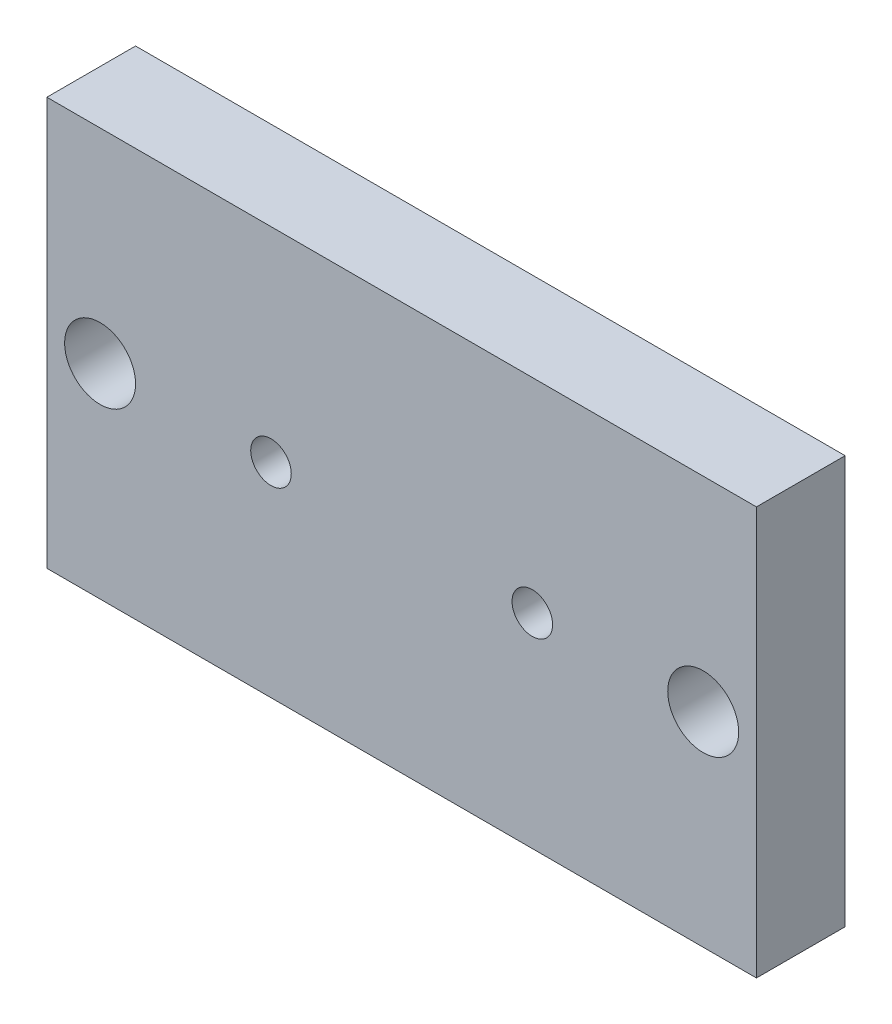
ISO-10303-21;
HEADER;
FILE_DESCRIPTION(('STEP AP214'),'2;1');
FILE_NAME('part.step','',(''),(''),'','','');
FILE_SCHEMA(('AUTOMOTIVE_DESIGN { 1 0 10303 214 1 1 1 1 }'));
ENDSEC;
DATA;
#1=APPLICATION_CONTEXT('core data for automotive mechanical design processes');
#2=APPLICATION_PROTOCOL_DEFINITION('international standard','automotive_design',2000,#1);
#3=PRODUCT_CONTEXT('',#1,'mechanical');
#4=PRODUCT('Part','Part','',(#3));
#5=PRODUCT_RELATED_PRODUCT_CATEGORY('part','',(#4));
#6=PRODUCT_DEFINITION_FORMATION('','',#4);
#7=PRODUCT_DEFINITION_CONTEXT('part definition',#1,'design');
#8=PRODUCT_DEFINITION('design','',#6,#7);
#9=PRODUCT_DEFINITION_SHAPE('','',#8);
#10=(LENGTH_UNIT() NAMED_UNIT(*) SI_UNIT(.MILLI.,.METRE.));
#11=(NAMED_UNIT(*) PLANE_ANGLE_UNIT() SI_UNIT($,.RADIAN.));
#12=(NAMED_UNIT(*) SI_UNIT($,.STERADIAN.) SOLID_ANGLE_UNIT());
#13=UNCERTAINTY_MEASURE_WITH_UNIT(LENGTH_MEASURE(1.E-05),#10,'distance_accuracy_value','');
#14=(GEOMETRIC_REPRESENTATION_CONTEXT(3) GLOBAL_UNCERTAINTY_ASSIGNED_CONTEXT((#13)) GLOBAL_UNIT_ASSIGNED_CONTEXT((#10,
#11,#12)) REPRESENTATION_CONTEXT('',''));
#15=CARTESIAN_POINT('',(0.,0.,0.));
#16=DIRECTION('',(0.,0.,1.));
#17=DIRECTION('',(1.,0.,0.));
#18=AXIS2_PLACEMENT_3D('',#15,#16,#17);
#19=CARTESIAN_POINT('',(-20.,11.5,5.));
#20=DIRECTION('',(1.,0.,0.));
#21=DIRECTION('',(0.,1.,0.));
#22=AXIS2_PLACEMENT_3D('',#19,#20,#21);
#23=PLANE('',#22);
#24=DIRECTION('',(0.,-1.,0.));
#25=VECTOR('',#24,1.);
#26=CARTESIAN_POINT('',(-20.,11.5,0.));
#27=LINE('',#26,#25);
#28=CARTESIAN_POINT('',(-20.,11.5,0.));
#29=VERTEX_POINT('',#28);
#30=CARTESIAN_POINT('',(-20.,-11.5,0.));
#31=VERTEX_POINT('',#30);
#32=EDGE_CURVE('E99',#29,#31,#27,.T.);
#33=ORIENTED_EDGE('',*,*,#32,.T.);
#34=DIRECTION('',(0.,0.,-1.));
#35=VECTOR('',#34,1.);
#36=CARTESIAN_POINT('',(-20.,-11.5,5.));
#37=LINE('',#36,#35);
#38=CARTESIAN_POINT('',(-20.,-11.5,5.));
#39=VERTEX_POINT('',#38);
#40=EDGE_CURVE('E11',#39,#31,#37,.T.);
#41=ORIENTED_EDGE('',*,*,#40,.F.);
#42=DIRECTION('',(0.,-1.,0.));
#43=VECTOR('',#42,1.);
#44=CARTESIAN_POINT('',(-20.,11.5,5.));
#45=LINE('',#44,#43);
#46=CARTESIAN_POINT('',(-20.,11.5,5.));
#47=VERTEX_POINT('',#46);
#48=EDGE_CURVE('E87',#47,#39,#45,.T.);
#49=ORIENTED_EDGE('',*,*,#48,.F.);
#50=DIRECTION('',(0.,0.,-1.));
#51=VECTOR('',#50,1.);
#52=CARTESIAN_POINT('',(-20.,11.5,5.));
#53=LINE('',#52,#51);
#54=EDGE_CURVE('E95',#47,#29,#53,.T.);
#55=ORIENTED_EDGE('',*,*,#54,.T.);
#56=EDGE_LOOP('',(#33,#41,#49,#55));
#57=FACE_BOUND('',#56,.T.);
#58=ADVANCED_FACE('F36',(#57),#23,.F.);
#59=CARTESIAN_POINT('',(-20.,-11.5,5.));
#60=DIRECTION('',(0.,1.,0.));
#61=DIRECTION('',(0.,0.,1.));
#62=AXIS2_PLACEMENT_3D('',#59,#60,#61);
#63=PLANE('',#62);
#64=DIRECTION('',(1.,0.,0.));
#65=VECTOR('',#64,1.);
#66=CARTESIAN_POINT('',(-20.,-11.5,0.));
#67=LINE('',#66,#65);
#68=CARTESIAN_POINT('',(20.,-11.5,0.));
#69=VERTEX_POINT('',#68);
#70=EDGE_CURVE('E91',#31,#69,#67,.T.);
#71=ORIENTED_EDGE('',*,*,#70,.T.);
#72=DIRECTION('',(0.,0.,-1.));
#73=VECTOR('',#72,1.);
#74=CARTESIAN_POINT('',(20.,-11.5,5.));
#75=LINE('',#74,#73);
#76=CARTESIAN_POINT('',(20.,-11.5,5.));
#77=VERTEX_POINT('',#76);
#78=EDGE_CURVE('E44',#77,#69,#75,.T.);
#79=ORIENTED_EDGE('',*,*,#78,.F.);
#80=DIRECTION('',(1.,0.,0.));
#81=VECTOR('',#80,1.);
#82=CARTESIAN_POINT('',(-20.,-11.5,5.));
#83=LINE('',#82,#81);
#84=EDGE_CURVE('E82',#39,#77,#83,.T.);
#85=ORIENTED_EDGE('',*,*,#84,.F.);
#86=ORIENTED_EDGE('',*,*,#40,.T.);
#87=EDGE_LOOP('',(#71,#79,#85,#86));
#88=FACE_BOUND('',#87,.T.);
#89=ADVANCED_FACE('F90',(#88),#63,.F.);
#90=CARTESIAN_POINT('',(20.,11.5,5.));
#91=DIRECTION('',(-1.,0.,0.));
#92=DIRECTION('',(0.,-1.,0.));
#93=AXIS2_PLACEMENT_3D('',#90,#91,#92);
#94=PLANE('',#93);
#95=DIRECTION('',(0.,1.,0.));
#96=VECTOR('',#95,1.);
#97=CARTESIAN_POINT('',(20.,11.5,0.));
#98=LINE('',#97,#96);
#99=CARTESIAN_POINT('',(20.,11.5,0.));
#100=VERTEX_POINT('',#99);
#101=EDGE_CURVE('E69',#69,#100,#98,.T.);
#102=ORIENTED_EDGE('',*,*,#101,.T.);
#103=DIRECTION('',(0.,0.,-1.));
#104=VECTOR('',#103,1.);
#105=CARTESIAN_POINT('',(20.,11.5,5.));
#106=LINE('',#105,#104);
#107=CARTESIAN_POINT('',(20.,11.5,5.));
#108=VERTEX_POINT('',#107);
#109=EDGE_CURVE('E92',#108,#100,#106,.T.);
#110=ORIENTED_EDGE('',*,*,#109,.F.);
#111=DIRECTION('',(0.,1.,0.));
#112=VECTOR('',#111,1.);
#113=CARTESIAN_POINT('',(20.,11.5,5.));
#114=LINE('',#113,#112);
#115=EDGE_CURVE('E85',#77,#108,#114,.T.);
#116=ORIENTED_EDGE('',*,*,#115,.F.);
#117=ORIENTED_EDGE('',*,*,#78,.T.);
#118=EDGE_LOOP('',(#102,#110,#116,#117));
#119=FACE_BOUND('',#118,.T.);
#120=ADVANCED_FACE('F93',(#119),#94,.F.);
#121=CARTESIAN_POINT('',(-20.,11.5,5.));
#122=DIRECTION('',(0.,-1.,0.));
#123=DIRECTION('',(0.,0.,-1.));
#124=AXIS2_PLACEMENT_3D('',#121,#122,#123);
#125=PLANE('',#124);
#126=DIRECTION('',(-1.,0.,0.));
#127=VECTOR('',#126,1.);
#128=CARTESIAN_POINT('',(-20.,11.5,0.));
#129=LINE('',#128,#127);
#130=EDGE_CURVE('E75',#100,#29,#129,.T.);
#131=ORIENTED_EDGE('',*,*,#130,.T.);
#132=ORIENTED_EDGE('',*,*,#54,.F.);
#133=DIRECTION('',(-1.,0.,0.));
#134=VECTOR('',#133,1.);
#135=CARTESIAN_POINT('',(-20.,11.5,5.));
#136=LINE('',#135,#134);
#137=EDGE_CURVE('E52',#108,#47,#136,.T.);
#138=ORIENTED_EDGE('',*,*,#137,.F.);
#139=ORIENTED_EDGE('',*,*,#109,.T.);
#140=EDGE_LOOP('',(#131,#132,#138,#139));
#141=FACE_BOUND('',#140,.T.);
#142=ADVANCED_FACE('F107',(#141),#125,.F.);
#143=CARTESIAN_POINT('',(0.,0.,5.));
#144=DIRECTION('',(0.,0.,1.));
#145=DIRECTION('',(1.,0.,0.));
#146=AXIS2_PLACEMENT_3D('',#143,#144,#145);
#147=PLANE('',#146);
#148=CARTESIAN_POINT('',(16.9999999999999,0.,5.));
#149=DIRECTION('',(0.,0.,1.));
#150=DIRECTION('',(1.,0.,0.));
#151=AXIS2_PLACEMENT_3D('',#148,#149,#150);
#152=CIRCLE('',#151,2.00000000000001);
#153=CARTESIAN_POINT('',(18.9999999999999,0.,5.));
#154=VERTEX_POINT('',#153);
#155=EDGE_CURVE('E102',#154,#154,#152,.T.);
#156=ORIENTED_EDGE('',*,*,#155,.F.);
#157=EDGE_LOOP('',(#156));
#158=FACE_BOUND('',#157,.T.);
#159=CARTESIAN_POINT('',(7.36599999999997,0.,5.));
#160=DIRECTION('',(0.,0.,1.));
#161=DIRECTION('',(1.,0.,0.));
#162=AXIS2_PLACEMENT_3D('',#159,#160,#161);
#163=CIRCLE('',#162,1.143);
#164=CARTESIAN_POINT('',(8.50899999999997,0.,5.));
#165=VERTEX_POINT('',#164);
#166=EDGE_CURVE('E115',#165,#165,#163,.T.);
#167=ORIENTED_EDGE('',*,*,#166,.F.);
#168=EDGE_LOOP('',(#167));
#169=FACE_BOUND('',#168,.T.);
#170=CARTESIAN_POINT('',(-7.36600000000003,0.,5.));
#171=DIRECTION('',(0.,0.,1.));
#172=DIRECTION('',(1.,0.,0.));
#173=AXIS2_PLACEMENT_3D('',#170,#171,#172);
#174=CIRCLE('',#173,1.143);
#175=CARTESIAN_POINT('',(-6.22300000000003,0.,5.));
#176=VERTEX_POINT('',#175);
#177=EDGE_CURVE('E118',#176,#176,#174,.T.);
#178=ORIENTED_EDGE('',*,*,#177,.F.);
#179=EDGE_LOOP('',(#178));
#180=FACE_BOUND('',#179,.T.);
#181=CARTESIAN_POINT('',(-17.0000000000001,0.,5.));
#182=DIRECTION('',(0.,0.,1.));
#183=DIRECTION('',(1.,0.,0.));
#184=AXIS2_PLACEMENT_3D('',#181,#182,#183);
#185=CIRCLE('',#184,2.);
#186=CARTESIAN_POINT('',(-15.0000000000001,0.,5.));
#187=VERTEX_POINT('',#186);
#188=EDGE_CURVE('E121',#187,#187,#185,.T.);
#189=ORIENTED_EDGE('',*,*,#188,.F.);
#190=EDGE_LOOP('',(#189));
#191=FACE_BOUND('',#190,.T.);
#192=ORIENTED_EDGE('',*,*,#48,.T.);
#193=ORIENTED_EDGE('',*,*,#84,.T.);
#194=ORIENTED_EDGE('',*,*,#115,.T.);
#195=ORIENTED_EDGE('',*,*,#137,.T.);
#196=EDGE_LOOP('',(#192,#193,#194,#195));
#197=FACE_BOUND('',#196,.T.);
#198=ADVANCED_FACE('F83',(#158,#169,#180,#191,#197),#147,.T.);
#199=CARTESIAN_POINT('',(0.,0.,0.));
#200=DIRECTION('',(0.,0.,1.));
#201=DIRECTION('',(1.,0.,0.));
#202=AXIS2_PLACEMENT_3D('',#199,#200,#201);
#203=PLANE('',#202);
#204=CARTESIAN_POINT('',(16.9999999999999,0.,0.));
#205=DIRECTION('',(0.,0.,-1.));
#206=DIRECTION('',(-1.,0.,0.));
#207=AXIS2_PLACEMENT_3D('',#204,#205,#206);
#208=CIRCLE('',#207,2.00000000000001);
#209=CARTESIAN_POINT('',(14.9999999999999,0.,0.));
#210=VERTEX_POINT('',#209);
#211=EDGE_CURVE('E124',#210,#210,#208,.T.);
#212=ORIENTED_EDGE('',*,*,#211,.F.);
#213=EDGE_LOOP('',(#212));
#214=FACE_BOUND('',#213,.T.);
#215=CARTESIAN_POINT('',(7.36599999999997,0.,0.));
#216=DIRECTION('',(0.,0.,-1.));
#217=DIRECTION('',(-1.,0.,0.));
#218=AXIS2_PLACEMENT_3D('',#215,#216,#217);
#219=CIRCLE('',#218,1.143);
#220=CARTESIAN_POINT('',(6.22299999999997,0.,0.));
#221=VERTEX_POINT('',#220);
#222=EDGE_CURVE('E131',#221,#221,#219,.T.);
#223=ORIENTED_EDGE('',*,*,#222,.F.);
#224=EDGE_LOOP('',(#223));
#225=FACE_BOUND('',#224,.T.);
#226=CARTESIAN_POINT('',(-7.36600000000003,0.,0.));
#227=DIRECTION('',(0.,0.,-1.));
#228=DIRECTION('',(-1.,0.,0.));
#229=AXIS2_PLACEMENT_3D('',#226,#227,#228);
#230=CIRCLE('',#229,1.143);
#231=CARTESIAN_POINT('',(-8.50900000000003,0.,0.));
#232=VERTEX_POINT('',#231);
#233=EDGE_CURVE('E128',#232,#232,#230,.T.);
#234=ORIENTED_EDGE('',*,*,#233,.F.);
#235=EDGE_LOOP('',(#234));
#236=FACE_BOUND('',#235,.T.);
#237=CARTESIAN_POINT('',(-17.0000000000001,0.,0.));
#238=DIRECTION('',(0.,0.,-1.));
#239=DIRECTION('',(-1.,0.,0.));
#240=AXIS2_PLACEMENT_3D('',#237,#238,#239);
#241=CIRCLE('',#240,2.);
#242=CARTESIAN_POINT('',(-19.0000000000001,0.,0.));
#243=VERTEX_POINT('',#242);
#244=EDGE_CURVE('E125',#243,#243,#241,.T.);
#245=ORIENTED_EDGE('',*,*,#244,.F.);
#246=EDGE_LOOP('',(#245));
#247=FACE_BOUND('',#246,.T.);
#248=ORIENTED_EDGE('',*,*,#32,.F.);
#249=ORIENTED_EDGE('',*,*,#130,.F.);
#250=ORIENTED_EDGE('',*,*,#101,.F.);
#251=ORIENTED_EDGE('',*,*,#70,.F.);
#252=EDGE_LOOP('',(#248,#249,#250,#251));
#253=FACE_BOUND('',#252,.T.);
#254=ADVANCED_FACE('F110',(#214,#225,#236,#247,#253),#203,.F.);
#255=CARTESIAN_POINT('',(-17.0000000000001,0.,10.));
#256=DIRECTION('',(0.,0.,-1.));
#257=DIRECTION('',(-1.,0.,0.));
#258=AXIS2_PLACEMENT_3D('',#255,#256,#257);
#259=CYLINDRICAL_SURFACE('',#258,2.);
#260=ORIENTED_EDGE('',*,*,#188,.T.);
#261=EDGE_LOOP('',(#260));
#262=FACE_BOUND('',#261,.T.);
#263=ORIENTED_EDGE('',*,*,#244,.T.);
#264=EDGE_LOOP('',(#263));
#265=FACE_BOUND('',#264,.T.);
#266=ADVANCED_FACE('F141',(#262,#265),#259,.F.);
#267=CARTESIAN_POINT('',(-7.36600000000003,0.,10.));
#268=DIRECTION('',(0.,0.,-1.));
#269=DIRECTION('',(-1.,0.,0.));
#270=AXIS2_PLACEMENT_3D('',#267,#268,#269);
#271=CYLINDRICAL_SURFACE('',#270,1.143);
#272=ORIENTED_EDGE('',*,*,#177,.T.);
#273=EDGE_LOOP('',(#272));
#274=FACE_BOUND('',#273,.T.);
#275=ORIENTED_EDGE('',*,*,#233,.T.);
#276=EDGE_LOOP('',(#275));
#277=FACE_BOUND('',#276,.T.);
#278=ADVANCED_FACE('F150',(#274,#277),#271,.F.);
#279=CARTESIAN_POINT('',(7.36599999999997,0.,10.));
#280=DIRECTION('',(0.,0.,-1.));
#281=DIRECTION('',(-1.,0.,0.));
#282=AXIS2_PLACEMENT_3D('',#279,#280,#281);
#283=CYLINDRICAL_SURFACE('',#282,1.143);
#284=ORIENTED_EDGE('',*,*,#166,.T.);
#285=EDGE_LOOP('',(#284));
#286=FACE_BOUND('',#285,.T.);
#287=ORIENTED_EDGE('',*,*,#222,.T.);
#288=EDGE_LOOP('',(#287));
#289=FACE_BOUND('',#288,.T.);
#290=ADVANCED_FACE('F156',(#286,#289),#283,.F.);
#291=CARTESIAN_POINT('',(16.9999999999999,0.,10.));
#292=DIRECTION('',(0.,0.,-1.));
#293=DIRECTION('',(-1.,0.,0.));
#294=AXIS2_PLACEMENT_3D('',#291,#292,#293);
#295=CYLINDRICAL_SURFACE('',#294,2.00000000000001);
#296=ORIENTED_EDGE('',*,*,#155,.T.);
#297=EDGE_LOOP('',(#296));
#298=FACE_BOUND('',#297,.T.);
#299=ORIENTED_EDGE('',*,*,#211,.T.);
#300=EDGE_LOOP('',(#299));
#301=FACE_BOUND('',#300,.T.);
#302=ADVANCED_FACE('F137',(#298,#301),#295,.F.);
#303=CLOSED_SHELL('',(#58,#89,#120,#142,#198,#254,#266,#278,#290,#302));
#304=MANIFOLD_SOLID_BREP('B2',#303);
#305=ADVANCED_BREP_SHAPE_REPRESENTATION('',(#18,#304),#14);
#306=SHAPE_DEFINITION_REPRESENTATION(#9,#305);
ENDSEC;
END-ISO-10303-21;
